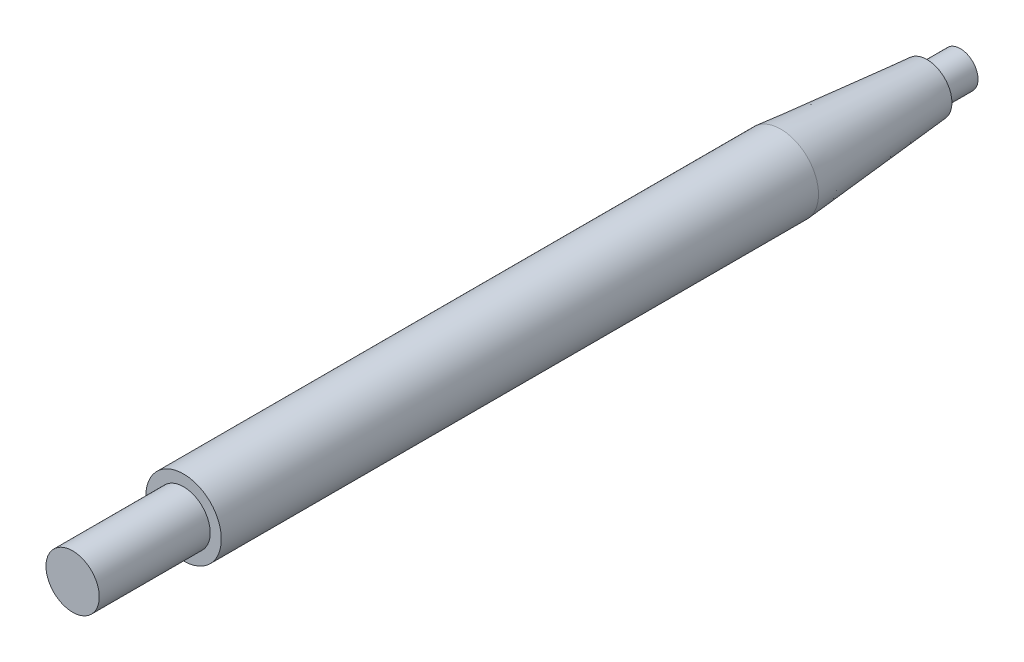
ISO-10303-21;
HEADER;
FILE_DESCRIPTION(('STEP AP214'),'2;1');
FILE_NAME('part.step','',(''),(''),'','','');
FILE_SCHEMA(('AUTOMOTIVE_DESIGN { 1 0 10303 214 1 1 1 1 }'));
ENDSEC;
DATA;
#1=APPLICATION_CONTEXT('core data for automotive mechanical design processes');
#2=APPLICATION_PROTOCOL_DEFINITION('international standard','automotive_design',2000,#1);
#3=PRODUCT_CONTEXT('',#1,'mechanical');
#4=PRODUCT('Part','Part','',(#3));
#5=PRODUCT_RELATED_PRODUCT_CATEGORY('part','',(#4));
#6=PRODUCT_DEFINITION_FORMATION('','',#4);
#7=PRODUCT_DEFINITION_CONTEXT('part definition',#1,'design');
#8=PRODUCT_DEFINITION('design','',#6,#7);
#9=PRODUCT_DEFINITION_SHAPE('','',#8);
#10=(LENGTH_UNIT() NAMED_UNIT(*) SI_UNIT(.MILLI.,.METRE.));
#11=(NAMED_UNIT(*) PLANE_ANGLE_UNIT() SI_UNIT($,.RADIAN.));
#12=(NAMED_UNIT(*) SI_UNIT($,.STERADIAN.) SOLID_ANGLE_UNIT());
#13=UNCERTAINTY_MEASURE_WITH_UNIT(LENGTH_MEASURE(1.E-05),#10,'distance_accuracy_value','');
#14=(GEOMETRIC_REPRESENTATION_CONTEXT(3) GLOBAL_UNCERTAINTY_ASSIGNED_CONTEXT((#13)) GLOBAL_UNIT_ASSIGNED_CONTEXT((#10,
#11,#12)) REPRESENTATION_CONTEXT('',''));
#15=CARTESIAN_POINT('',(0.,0.,0.));
#16=DIRECTION('',(0.,0.,1.));
#17=DIRECTION('',(1.,0.,0.));
#18=AXIS2_PLACEMENT_3D('',#15,#16,#17);
#19=CARTESIAN_POINT('',(-10.8434851061855,0.,38.5074006138957));
#20=DIRECTION('',(0.,0.,-1.));
#21=DIRECTION('',(-1.,0.,0.));
#22=AXIS2_PLACEMENT_3D('',#19,#20,#21);
#23=PLANE('',#22);
#24=CARTESIAN_POINT('',(-16.8434851061855,0.,38.5074006138957));
#25=DIRECTION('',(0.,0.,-1.));
#26=DIRECTION('',(-1.,0.,0.));
#27=AXIS2_PLACEMENT_3D('',#24,#25,#26);
#28=CIRCLE('',#27,6.);
#29=CARTESIAN_POINT('',(-22.8434851061855,0.,38.5074006138957));
#30=VERTEX_POINT('',#29);
#31=EDGE_CURVE('E10',#30,#30,#28,.T.);
#32=ORIENTED_EDGE('',*,*,#31,.F.);
#33=EDGE_LOOP('',(#32));
#34=FACE_BOUND('',#33,.T.);
#35=ADVANCED_FACE('F46',(#34),#23,.F.);
#36=CARTESIAN_POINT('',(-16.8434851061855,0.,-161.492599386104));
#37=DIRECTION('',(0.,0.,-1.));
#38=DIRECTION('',(-1.,0.,0.));
#39=AXIS2_PLACEMENT_3D('',#36,#37,#38);
#40=CYLINDRICAL_SURFACE('',#39,6.);
#41=CARTESIAN_POINT('',(-16.8434851061855,0.,13.5074006138957));
#42=DIRECTION('',(0.,0.,-1.));
#43=DIRECTION('',(-1.,0.,0.));
#44=AXIS2_PLACEMENT_3D('',#41,#42,#43);
#45=CIRCLE('',#44,5.99999999999999);
#46=CARTESIAN_POINT('',(-22.8434851061855,0.,13.5074006138957));
#47=VERTEX_POINT('',#46);
#48=EDGE_CURVE('E52',#47,#47,#45,.T.);
#49=ORIENTED_EDGE('',*,*,#48,.F.);
#50=EDGE_LOOP('',(#49));
#51=FACE_BOUND('',#50,.T.);
#52=ORIENTED_EDGE('',*,*,#31,.T.);
#53=EDGE_LOOP('',(#52));
#54=FACE_BOUND('',#53,.T.);
#55=ADVANCED_FACE('F103',(#51,#54),#40,.T.);
#56=CARTESIAN_POINT('',(-8.34348510618554,0.,13.5074006138957));
#57=DIRECTION('',(0.,0.,-1.));
#58=DIRECTION('',(-1.,0.,0.));
#59=AXIS2_PLACEMENT_3D('',#56,#57,#58);
#60=PLANE('',#59);
#61=CARTESIAN_POINT('',(-16.8434851061855,0.,13.5074006138957));
#62=DIRECTION('',(0.,0.,-1.));
#63=DIRECTION('',(-1.,0.,0.));
#64=AXIS2_PLACEMENT_3D('',#61,#62,#63);
#65=CIRCLE('',#64,8.5);
#66=CARTESIAN_POINT('',(-25.3434851061855,0.,13.5074006138957));
#67=VERTEX_POINT('',#66);
#68=EDGE_CURVE('E56',#67,#67,#65,.T.);
#69=ORIENTED_EDGE('',*,*,#68,.F.);
#70=EDGE_LOOP('',(#69));
#71=FACE_BOUND('',#70,.T.);
#72=ORIENTED_EDGE('',*,*,#48,.T.);
#73=EDGE_LOOP('',(#72));
#74=FACE_BOUND('',#73,.T.);
#75=ADVANCED_FACE('F98',(#71,#74),#60,.F.);
#76=CARTESIAN_POINT('',(-16.8434851061855,0.,-161.492599386104));
#77=DIRECTION('',(0.,0.,-1.));
#78=DIRECTION('',(-1.,0.,0.));
#79=AXIS2_PLACEMENT_3D('',#76,#77,#78);
#80=CYLINDRICAL_SURFACE('',#79,8.5);
#81=CARTESIAN_POINT('',(-16.8434851061855,0.,-121.052599386104));
#82=DIRECTION('',(0.,0.,-1.));
#83=DIRECTION('',(-1.,0.,0.));
#84=AXIS2_PLACEMENT_3D('',#81,#82,#83);
#85=CIRCLE('',#84,8.5);
#86=CARTESIAN_POINT('',(-25.3434851061856,0.,-121.052599386104));
#87=VERTEX_POINT('',#86);
#88=EDGE_CURVE('E60',#87,#87,#85,.T.);
#89=ORIENTED_EDGE('',*,*,#88,.F.);
#90=EDGE_LOOP('',(#89));
#91=FACE_BOUND('',#90,.T.);
#92=ORIENTED_EDGE('',*,*,#68,.T.);
#93=EDGE_LOOP('',(#92));
#94=FACE_BOUND('',#93,.T.);
#95=ADVANCED_FACE('F92',(#91,#94),#80,.T.);
#96=CARTESIAN_POINT('',(-16.8434851061855,0.,-121.052599386104));
#97=DIRECTION('',(0.,0.,1.));
#98=DIRECTION('',(1.,0.,0.));
#99=AXIS2_PLACEMENT_3D('',#96,#97,#98);
#100=CONICAL_SURFACE('',#99,8.5,0.0872664625997167);
#101=CARTESIAN_POINT('',(-16.8434851061855,0.,-153.992599386104));
#102=DIRECTION('',(0.,0.,-1.));
#103=DIRECTION('',(-1.,0.,0.));
#104=AXIS2_PLACEMENT_3D('',#101,#102,#103);
#105=CIRCLE('',#104,5.61812342345606);
#106=CARTESIAN_POINT('',(-22.4616085296416,0.,-153.992599386104));
#107=VERTEX_POINT('',#106);
#108=EDGE_CURVE('E65',#107,#107,#105,.T.);
#109=ORIENTED_EDGE('',*,*,#108,.F.);
#110=EDGE_LOOP('',(#109));
#111=FACE_BOUND('',#110,.T.);
#112=ORIENTED_EDGE('',*,*,#88,.T.);
#113=EDGE_LOOP('',(#112));
#114=FACE_BOUND('',#113,.T.);
#115=ADVANCED_FACE('F86',(#111,#114),#100,.T.);
#116=CARTESIAN_POINT('',(-11.2253616827295,0.,-153.992599386104));
#117=DIRECTION('',(0.,0.,1.));
#118=DIRECTION('',(1.,0.,0.));
#119=AXIS2_PLACEMENT_3D('',#116,#117,#118);
#120=PLANE('',#119);
#121=CARTESIAN_POINT('',(-16.8434851061855,0.,-153.992599386104));
#122=DIRECTION('',(0.,0.,-1.));
#123=DIRECTION('',(-1.,0.,0.));
#124=AXIS2_PLACEMENT_3D('',#121,#122,#123);
#125=CIRCLE('',#124,4.);
#126=CARTESIAN_POINT('',(-20.8434851061856,0.,-153.992599386104));
#127=VERTEX_POINT('',#126);
#128=EDGE_CURVE('E68',#127,#127,#125,.T.);
#129=ORIENTED_EDGE('',*,*,#128,.F.);
#130=EDGE_LOOP('',(#129));
#131=FACE_BOUND('',#130,.T.);
#132=ORIENTED_EDGE('',*,*,#108,.T.);
#133=EDGE_LOOP('',(#132));
#134=FACE_BOUND('',#133,.T.);
#135=ADVANCED_FACE('F80',(#131,#134),#120,.F.);
#136=CARTESIAN_POINT('',(-16.8434851061855,0.,-161.492599386104));
#137=DIRECTION('',(0.,0.,-1.));
#138=DIRECTION('',(-1.,0.,0.));
#139=AXIS2_PLACEMENT_3D('',#136,#137,#138);
#140=CYLINDRICAL_SURFACE('',#139,4.);
#141=CARTESIAN_POINT('',(-16.8434851061855,0.,-161.492599386104));
#142=DIRECTION('',(0.,0.,-1.));
#143=DIRECTION('',(-1.,0.,0.));
#144=AXIS2_PLACEMENT_3D('',#141,#142,#143);
#145=CIRCLE('',#144,4.);
#146=CARTESIAN_POINT('',(-20.8434851061856,0.,-161.492599386104));
#147=VERTEX_POINT('',#146);
#148=EDGE_CURVE('E71',#147,#147,#145,.T.);
#149=ORIENTED_EDGE('',*,*,#148,.F.);
#150=EDGE_LOOP('',(#149));
#151=FACE_BOUND('',#150,.T.);
#152=ORIENTED_EDGE('',*,*,#128,.T.);
#153=EDGE_LOOP('',(#152));
#154=FACE_BOUND('',#153,.T.);
#155=ADVANCED_FACE('F77',(#151,#154),#140,.T.);
#156=CARTESIAN_POINT('',(-12.8434851061855,0.,-161.492599386104));
#157=DIRECTION('',(0.,0.,1.));
#158=DIRECTION('',(1.,0.,0.));
#159=AXIS2_PLACEMENT_3D('',#156,#157,#158);
#160=PLANE('',#159);
#161=ORIENTED_EDGE('',*,*,#148,.T.);
#162=EDGE_LOOP('',(#161));
#163=FACE_BOUND('',#162,.T.);
#164=ADVANCED_FACE('F75',(#163),#160,.F.);
#165=CLOSED_SHELL('',(#35,#55,#75,#95,#115,#135,#155,#164));
#166=MANIFOLD_SOLID_BREP('B2',#165);
#167=ADVANCED_BREP_SHAPE_REPRESENTATION('',(#18,#166),#14);
#168=SHAPE_DEFINITION_REPRESENTATION(#9,#167);
ENDSEC;
END-ISO-10303-21;
